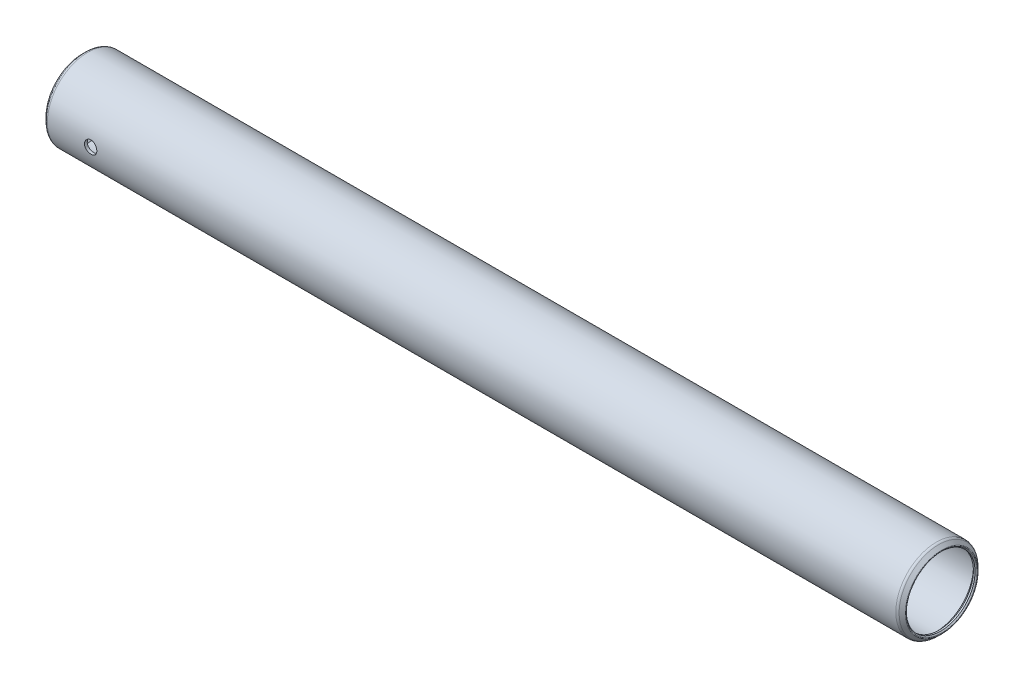
ISO-10303-21;
HEADER;
FILE_DESCRIPTION(('STEP AP214'),'2;1');
FILE_NAME('part.step','',(''),(''),'','','');
FILE_SCHEMA(('AUTOMOTIVE_DESIGN { 1 0 10303 214 1 1 1 1 }'));
ENDSEC;
DATA;
#1=APPLICATION_CONTEXT('core data for automotive mechanical design processes');
#2=APPLICATION_PROTOCOL_DEFINITION('international standard','automotive_design',2000,#1);
#3=PRODUCT_CONTEXT('',#1,'mechanical');
#4=PRODUCT('Part','Part','',(#3));
#5=PRODUCT_RELATED_PRODUCT_CATEGORY('part','',(#4));
#6=PRODUCT_DEFINITION_FORMATION('','',#4);
#7=PRODUCT_DEFINITION_CONTEXT('part definition',#1,'design');
#8=PRODUCT_DEFINITION('design','',#6,#7);
#9=PRODUCT_DEFINITION_SHAPE('','',#8);
#10=(LENGTH_UNIT() NAMED_UNIT(*) SI_UNIT(.MILLI.,.METRE.));
#11=(NAMED_UNIT(*) PLANE_ANGLE_UNIT() SI_UNIT($,.RADIAN.));
#12=(NAMED_UNIT(*) SI_UNIT($,.STERADIAN.) SOLID_ANGLE_UNIT());
#13=UNCERTAINTY_MEASURE_WITH_UNIT(LENGTH_MEASURE(1.E-05),#10,'distance_accuracy_value','');
#14=(GEOMETRIC_REPRESENTATION_CONTEXT(3) GLOBAL_UNCERTAINTY_ASSIGNED_CONTEXT((#13)) GLOBAL_UNIT_ASSIGNED_CONTEXT((#10,
#11,#12)) REPRESENTATION_CONTEXT('',''));
#15=CARTESIAN_POINT('',(0.,0.,0.));
#16=DIRECTION('',(0.,0.,1.));
#17=DIRECTION('',(1.,0.,0.));
#18=AXIS2_PLACEMENT_3D('',#15,#16,#17);
#19=CARTESIAN_POINT('',(164.8714,0.,0.));
#20=DIRECTION('',(-1.,0.,0.));
#21=DIRECTION('',(0.,0.,1.));
#22=AXIS2_PLACEMENT_3D('',#19,#20,#21);
#23=CYLINDRICAL_SURFACE('',#22,7.27075);
#24=CARTESIAN_POINT('',(0.634999999999997,0.,0.));
#25=DIRECTION('',(-1.,0.,0.));
#26=DIRECTION('',(0.,0.,1.));
#27=AXIS2_PLACEMENT_3D('',#24,#25,#26);
#28=CIRCLE('',#27,7.27075);
#29=CARTESIAN_POINT('',(0.634999999999997,0.,7.27075));
#30=VERTEX_POINT('',#29);
#31=EDGE_CURVE('E56',#30,#30,#28,.T.);
#32=ORIENTED_EDGE('',*,*,#31,.T.);
#33=EDGE_LOOP('',(#32));
#34=FACE_BOUND('',#33,.T.);
#35=CARTESIAN_POINT('',(164.2364,0.,0.));
#36=DIRECTION('',(-1.,0.,0.));
#37=DIRECTION('',(0.,0.,1.));
#38=AXIS2_PLACEMENT_3D('',#35,#36,#37);
#39=CIRCLE('',#38,7.27075);
#40=CARTESIAN_POINT('',(164.2364,0.,7.27075));
#41=VERTEX_POINT('',#40);
#42=EDGE_CURVE('E59',#41,#41,#39,.T.);
#43=ORIENTED_EDGE('',*,*,#42,.F.);
#44=EDGE_LOOP('',(#43));
#45=FACE_BOUND('',#44,.T.);
#46=CARTESIAN_POINT('',(10.0838,0.,7.27075));
#47=CARTESIAN_POINT('',(10.0837973180497,-0.066576365622315,7.27074886912623));
#48=CARTESIAN_POINT('',(10.0782118981357,-0.133189422139323,7.26982603229932));
#49=CARTESIAN_POINT('',(10.0560265204291,-0.264548230355834,7.26623351045891));
#50=CARTESIAN_POINT('',(10.0394163416924,-0.329292191059067,7.26356220448896));
#51=CARTESIAN_POINT('',(9.99569566198161,-0.454993226185557,7.25677245539045));
#52=CARTESIAN_POINT('',(9.96859364975716,-0.515953315921061,7.25265518241654));
#53=CARTESIAN_POINT('',(9.90468063110018,-0.632452772924966,7.24342655383445));
#54=CARTESIAN_POINT('',(9.86787077172315,-0.687992779555633,7.23831531568951));
#55=CARTESIAN_POINT('',(9.78522309678459,-0.792599473441388,7.22761255264284));
#56=CARTESIAN_POINT('',(9.73931276800991,-0.841608503171799,7.22201738797767));
#57=CARTESIAN_POINT('',(9.63992345556096,-0.931264098359722,7.21100533744942));
#58=CARTESIAN_POINT('',(9.5864440012438,-0.971910143426821,7.20558846269812));
#59=CARTESIAN_POINT('',(9.47303978470973,-1.04391602816968,7.19551105091629));
#60=CARTESIAN_POINT('',(9.4130784863992,-1.07521904168257,7.19085521714684));
#61=CARTESIAN_POINT('',(9.28865966029078,-1.12728692857892,7.18287741243743));
#62=CARTESIAN_POINT('',(9.22420242734068,-1.14805249228092,7.17955535412351));
#63=CARTESIAN_POINT('',(9.09323189607469,-1.17827475743791,7.17465739869155));
#64=CARTESIAN_POINT('',(9.02674212310514,-1.18783087478537,7.17306616036318));
#65=CARTESIAN_POINT('',(8.89308526182397,-1.19567118363748,7.1717635771999));
#66=CARTESIAN_POINT('',(8.82591822035366,-1.19395614941143,7.17205210323496));
#67=CARTESIAN_POINT('',(8.69352198271034,-1.17938385727069,7.17446243892077));
#68=CARTESIAN_POINT('',(8.62828012811038,-1.16663813068547,7.17656589715222));
#69=CARTESIAN_POINT('',(8.50087366450289,-1.13054122111993,7.18234037327412));
#70=CARTESIAN_POINT('',(8.43870915827104,-1.10718968419689,7.1860114434795));
#71=CARTESIAN_POINT('',(8.31888728068215,-1.05043049008399,7.19452739942117));
#72=CARTESIAN_POINT('',(8.26125231558848,-1.01697637582203,7.19937768730761));
#73=CARTESIAN_POINT('',(8.15237176299115,-0.940994666220349,7.20970179927714));
#74=CARTESIAN_POINT('',(8.10112667680563,-0.898466359673361,7.21517567221921));
#75=CARTESIAN_POINT('',(8.00583482220782,-0.804935108121529,7.22621089146952));
#76=CARTESIAN_POINT('',(7.9618819845089,-0.753836439796722,7.23177249832445));
#77=CARTESIAN_POINT('',(7.88316045636778,-0.644939097733325,7.24229566674746));
#78=CARTESIAN_POINT('',(7.84839182191106,-0.587140383155391,7.24725722465764));
#79=CARTESIAN_POINT('',(7.78901768412653,-0.466396392315688,7.25602800690079));
#80=CARTESIAN_POINT('',(7.76442031582416,-0.403447044565725,7.25983630820479));
#81=CARTESIAN_POINT('',(7.72617325530037,-0.274234269595053,7.26586402905181));
#82=CARTESIAN_POINT('',(7.71252267456644,-0.207971111808631,7.26808357754679));
#83=CARTESIAN_POINT('',(7.69668363687801,-0.0748214486822748,7.27066641036234));
#84=CARTESIAN_POINT('',(7.69436620334303,-0.00795067683835754,7.27105058098478));
#85=CARTESIAN_POINT('',(7.7009156211892,0.125223792320965,7.26997652394854));
#86=CARTESIAN_POINT('',(7.70978205534316,0.191527510698058,7.2685183650201));
#87=CARTESIAN_POINT('',(7.73834025080113,0.321288563764816,7.26393641843455));
#88=CARTESIAN_POINT('',(7.75796831562904,0.384760293010014,7.26082243459669));
#89=CARTESIAN_POINT('',(7.80742481444332,0.507512183164865,7.25327664455669));
#90=CARTESIAN_POINT('',(7.8372538071436,0.566792114271337,7.24884476617403));
#91=CARTESIAN_POINT('',(7.90656193459883,0.680038969103149,7.23910314951883));
#92=CARTESIAN_POINT('',(7.94612182885248,0.73395583434289,7.23378619167638));
#93=CARTESIAN_POINT('',(8.03365749864083,0.834431646594976,7.22288641864574));
#94=CARTESIAN_POINT('',(8.0816338663578,0.880990075429964,7.21730358477068));
#95=CARTESIAN_POINT('',(8.1852184168714,0.965904124062183,7.20643394566787));
#96=CARTESIAN_POINT('',(8.24089837915758,1.00417270523438,7.20115067484654));
#97=CARTESIAN_POINT('',(8.3579721887638,1.07081332476845,7.19154383416012));
#98=CARTESIAN_POINT('',(8.41936585880266,1.09918567005467,7.18722023453304));
#99=CARTESIAN_POINT('',(8.54587847689332,1.14509752192922,7.18004864937368));
#100=CARTESIAN_POINT('',(8.61098121151069,1.16268073492793,7.1771947179269));
#101=CARTESIAN_POINT('',(8.74326673649393,1.18665298984634,7.17327054668051));
#102=CARTESIAN_POINT('',(8.81044935138015,1.19304297353448,7.17220015681885));
#103=CARTESIAN_POINT('',(8.94411868459628,1.19442171212747,7.17197059783136));
#104=CARTESIAN_POINT('',(9.01060399046328,1.18954744526785,7.17278846653603));
#105=CARTESIAN_POINT('',(9.14179495108415,1.16883182625237,7.17619301197557));
#106=CARTESIAN_POINT('',(9.2065006111217,1.1529905066609,7.17877968345834));
#107=CARTESIAN_POINT('',(9.33224486958994,1.11084231835238,7.1854217631554));
#108=CARTESIAN_POINT('',(9.39328739677579,1.08454690132198,7.18947556380448));
#109=CARTESIAN_POINT('',(9.51011662462723,1.02225094487892,7.19859675637365));
#110=CARTESIAN_POINT('',(9.56590307708314,0.986249947445484,7.20366419612596));
#111=CARTESIAN_POINT('',(9.67132924911467,0.905074532377647,7.21431465232543));
#112=CARTESIAN_POINT('',(9.72089077079237,0.859799232508818,7.21990293486049));
#113=CARTESIAN_POINT('',(9.81176008561317,0.761573252640159,7.23092311461084));
#114=CARTESIAN_POINT('',(9.85306596960377,0.708620802139119,7.23635497540492));
#115=CARTESIAN_POINT('',(9.92650298013843,0.596123613416148,7.24649227103988));
#116=CARTESIAN_POINT('',(9.95857094627367,0.536537183511493,7.25119260851974));
#117=CARTESIAN_POINT('',(10.0121932411223,0.412771011536574,7.25928761210429));
#118=CARTESIAN_POINT('',(10.0337581058519,0.348595946921127,7.26268358593417));
#119=CARTESIAN_POINT('',(10.0610484764275,0.23680447760754,7.26704084527022));
#120=CARTESIAN_POINT('',(10.0695667313465,0.189866582690181,7.26842438895746));
#121=CARTESIAN_POINT('',(10.0809434065435,0.0952920506420502,7.27027936357523));
#122=CARTESIAN_POINT('',(10.0838019197425,0.0476554249959265,7.27075080948051));
#123=CARTESIAN_POINT('',(10.0838,0.,7.27075));
#124=B_SPLINE_CURVE_WITH_KNOTS('',3,(#46,#47,#48,#49,#50,#51,#52,#53,#54,#55,#56,#57,#58,#59,
#60,#61,#62,#63,#64,#65,#66,#67,#68,#69,#70,#71,#72,#73,#74,#75,#76,#77,#78,#79,#80,#81,#82,#83,
#84,#85,#86,#87,#88,#89,#90,#91,#92,#93,#94,#95,#96,#97,#98,#99,#100,#101,#102,#103,#104,#105,
#106,#107,#108,#109,#110,#111,#112,#113,#114,#115,#116,#117,#118,#119,#120,#121,#122,#123),
.UNSPECIFIED.,.T.,.F.,(4,2,2,2,2,2,2,2,2,2,2,2,2,2,2,2,2,2,2,2,2,2,2,2,2,2,2,2,2,2,2,2,2,2,2,2,
2,2,4),(0.,0.199554911258923,0.399295086783102,0.598873992821057,0.798429327660286,
0.999643746073527,1.20087068135868,1.40329768224392,1.60571142022758,1.80631605458478,
2.00690690859434,2.20549297418438,2.40408566758091,2.60360587488517,2.80314172571708,
3.00507606903131,3.20701164327729,3.40910841558579,3.61118878274413,3.81096394044209,
4.01073164551581,4.20932952359342,4.40793828079643,4.60825451749828,4.80858485408871,
5.01092627175881,5.2132614134035,5.41477139553096,5.61626442233168,5.81532011940715,
6.0143752254305,6.21321287954722,6.41205991875158,6.61319725023661,6.81438104193141,
7.01690935899602,7.2192340924611,7.36207803044844,7.50491962321452),.UNSPECIFIED.);
#125=CARTESIAN_POINT('',(10.0838,0.,7.27075));
#126=VERTEX_POINT('',#125);
#127=EDGE_CURVE('E89',#126,#126,#124,.T.);
#128=ORIENTED_EDGE('',*,*,#127,.F.);
#129=EDGE_LOOP('',(#128));
#130=FACE_BOUND('',#129,.T.);
#131=ADVANCED_FACE('F32',(#34,#45,#130),#23,.F.);
#132=CARTESIAN_POINT('',(164.8714,0.,0.));
#133=DIRECTION('',(-1.,0.,0.));
#134=DIRECTION('',(0.,0.,1.));
#135=AXIS2_PLACEMENT_3D('',#132,#133,#134);
#136=CYLINDRICAL_SURFACE('',#135,7.8105);
#137=CARTESIAN_POINT('',(0.539750000000006,0.,0.));
#138=DIRECTION('',(-1.,0.,0.));
#139=DIRECTION('',(0.,0.,1.));
#140=AXIS2_PLACEMENT_3D('',#137,#138,#139);
#141=CIRCLE('',#140,7.8105);
#142=CARTESIAN_POINT('',(0.539750000000006,0.,7.8105));
#143=VERTEX_POINT('',#142);
#144=EDGE_CURVE('E80',#143,#143,#141,.T.);
#145=ORIENTED_EDGE('',*,*,#144,.F.);
#146=EDGE_LOOP('',(#145));
#147=FACE_BOUND('',#146,.T.);
#148=CARTESIAN_POINT('',(164.33165,0.,0.));
#149=DIRECTION('',(-1.,0.,0.));
#150=DIRECTION('',(0.,0.,1.));
#151=AXIS2_PLACEMENT_3D('',#148,#149,#150);
#152=CIRCLE('',#151,7.8105);
#153=CARTESIAN_POINT('',(164.33165,0.,7.8105));
#154=VERTEX_POINT('',#153);
#155=EDGE_CURVE('E77',#154,#154,#152,.T.);
#156=ORIENTED_EDGE('',*,*,#155,.T.);
#157=EDGE_LOOP('',(#156));
#158=FACE_BOUND('',#157,.T.);
#159=CARTESIAN_POINT('',(7.6962,0.,7.8105));
#160=CARTESIAN_POINT('',(7.69620273646334,-0.0666398329516414,7.81049891819337));
#161=CARTESIAN_POINT('',(7.70179875326354,-0.133317958673531,7.80963820597065));
#162=CARTESIAN_POINT('',(7.72402870307655,-0.264809416860595,7.80628749873903));
#163=CARTESIAN_POINT('',(7.74067328590999,-0.329620887085572,7.80379593176562));
#164=CARTESIAN_POINT('',(7.78449052451775,-0.45545714903395,7.79746342374147));
#165=CARTESIAN_POINT('',(7.81165511534954,-0.516484800065449,7.79362351657722));
#166=CARTESIAN_POINT('',(7.8757213223107,-0.633106599576794,7.78501829240805));
#167=CARTESIAN_POINT('',(7.91262162540386,-0.688701479379162,7.78025310021736));
#168=CARTESIAN_POINT('',(7.99543012509601,-0.793338917825563,7.77028378661992));
#169=CARTESIAN_POINT('',(8.04140162993454,-0.842331101532475,7.76507673604042));
#170=CARTESIAN_POINT('',(8.14091132939096,-0.931937728182254,7.75483341589372));
#171=CARTESIAN_POINT('',(8.19444996561411,-0.972551681845018,7.74979715631489));
#172=CARTESIAN_POINT('',(8.30791388928797,-1.04444602601217,7.74043722961758));
#173=CARTESIAN_POINT('',(8.36787051185987,-1.07567749895494,7.73611734809356));
#174=CARTESIAN_POINT('',(8.49225550746949,-1.12760768906777,7.7287193916199));
#175=CARTESIAN_POINT('',(8.55668362710899,-1.14830700253877,7.72564124636873));
#176=CARTESIAN_POINT('',(8.68765223456345,-1.17842847148577,7.72110413933663));
#177=CARTESIAN_POINT('',(8.75417242189646,-1.18793699259909,7.71963278351321));
#178=CARTESIAN_POINT('',(8.88787920779012,-1.19567455444233,7.71843824249885));
#179=CARTESIAN_POINT('',(8.95506576640224,-1.19390426729727,7.7187149531374));
#180=CARTESIAN_POINT('',(9.08758697080283,-1.17920500612085,7.72097394960283));
#181=CARTESIAN_POINT('',(9.15293258817671,-1.1663723572181,7.72294151193834));
#182=CARTESIAN_POINT('',(9.2805321334076,-1.13006349376238,7.72833750921248));
#183=CARTESIAN_POINT('',(9.34278597068418,-1.10658696757771,7.73176598692365));
#184=CARTESIAN_POINT('',(9.46272710129188,-1.04955699193537,7.73971371623396));
#185=CARTESIAN_POINT('',(9.52039475442107,-1.01596287319965,7.74423735533787));
#186=CARTESIAN_POINT('',(9.62931092071928,-0.939680275121305,7.75386255655101));
#187=CARTESIAN_POINT('',(9.68055899632882,-0.896991176398325,7.75896415800917));
#188=CARTESIAN_POINT('',(9.77573941516313,-0.803202302304859,7.76923545638721));
#189=CARTESIAN_POINT('',(9.81959020348762,-0.752019737516411,7.77440531003558));
#190=CARTESIAN_POINT('',(9.89809225721203,-0.642978628610851,7.78418140470635));
#191=CARTESIAN_POINT('',(9.93274347948591,-0.58512005319953,7.78878764308655));
#192=CARTESIAN_POINT('',(9.99186750062159,-0.464297644984686,7.79692259066929));
#193=CARTESIAN_POINT('',(10.0163338579518,-0.401330611265675,7.80045061757113));
#194=CARTESIAN_POINT('',(10.0543219566975,-0.272115525346046,7.80602596435751));
#195=CARTESIAN_POINT('',(10.0678444666427,-0.205867703884927,7.80807338821605));
#196=CARTESIAN_POINT('',(10.083452224923,-0.0726752961455404,7.81044303454276));
#197=CARTESIAN_POINT('',(10.0856495678188,-0.00574413515528593,7.81078216464642));
#198=CARTESIAN_POINT('',(10.0788423665272,0.127530731520344,7.8097430834034));
#199=CARTESIAN_POINT('',(10.0698381828088,0.193874456040439,7.80836492731958));
#200=CARTESIAN_POINT('',(10.0409767408112,0.323750561669986,7.80405658307113));
#201=CARTESIAN_POINT('',(10.021174239059,0.387295393083128,7.801134227589));
#202=CARTESIAN_POINT('',(9.97133612750317,0.510163039330169,7.79406405147403));
#203=CARTESIAN_POINT('',(9.94130002129567,0.569485649186971,7.78991617139567));
#204=CARTESIAN_POINT('',(9.87158535899785,0.682716826559532,7.78081374744967));
#205=CARTESIAN_POINT('',(9.8318358743346,0.736581246218948,7.7758533626488));
#206=CARTESIAN_POINT('',(9.74392135369307,0.836914777941201,7.76569582861299));
#207=CARTESIAN_POINT('',(9.69575580884511,0.883383442501374,7.76049866507547));
#208=CARTESIAN_POINT('',(9.59187676543193,0.968015516456356,7.75039953957522));
#209=CARTESIAN_POINT('',(9.53610163726457,1.00610368490327,7.74550051674064));
#210=CARTESIAN_POINT('',(9.41887926951428,1.0723701852063,7.73660487547725));
#211=CARTESIAN_POINT('',(9.35743218781286,1.10054879279477,7.73260823194096));
#212=CARTESIAN_POINT('',(9.23083223960826,1.14608033509009,7.72599126936372));
#213=CARTESIAN_POINT('',(9.16569375894266,1.16347251312677,7.72336596666016));
#214=CARTESIAN_POINT('',(9.03337714917995,1.18706217797389,7.7197758016584));
#215=CARTESIAN_POINT('',(8.96619916717398,1.19326047015901,7.7188108199041));
#216=CARTESIAN_POINT('',(8.83246065644958,1.19426671409332,7.71865513002324));
#217=CARTESIAN_POINT('',(8.7659010093451,1.1891929893523,7.71944599058299));
#218=CARTESIAN_POINT('',(8.63459358788535,1.16805316013447,7.7226727629834));
#219=CARTESIAN_POINT('',(8.56984581017547,1.15198707601091,7.72510867177811));
#220=CARTESIAN_POINT('',(8.44403499975099,1.10936100617533,7.7313445390143));
#221=CARTESIAN_POINT('',(8.3829689992873,1.08280960626525,7.73514338119836));
#222=CARTESIAN_POINT('',(8.2661392148611,1.01997843077836,7.74367839169512));
#223=CARTESIAN_POINT('',(8.21037562436221,0.983698300423657,7.74841459418893));
#224=CARTESIAN_POINT('',(8.1051329581918,0.902010873076255,7.75834980029298));
#225=CARTESIAN_POINT('',(8.05572221542002,0.85651603304771,7.76355295388559));
#226=CARTESIAN_POINT('',(7.96519469079388,0.757875626120004,7.77380140805301));
#227=CARTESIAN_POINT('',(7.92407983676741,0.704728285811561,7.77884667170718));
#228=CARTESIAN_POINT('',(7.85109994244319,0.591932735192255,7.78824397715299));
#229=CARTESIAN_POINT('',(7.81928922643542,0.532249036280569,7.79259188322355));
#230=CARTESIAN_POINT('',(7.7661918482117,0.408346764692882,7.80006409876217));
#231=CARTESIAN_POINT('',(7.74489435433406,0.344132937672259,7.80318966689916));
#232=CARTESIAN_POINT('',(7.71822554780552,0.233031005484256,7.80715669112726));
#233=CARTESIAN_POINT('',(7.70997868826911,0.18682655953323,7.80840395032583));
#234=CARTESIAN_POINT('',(7.69896498773605,0.0937543885835004,7.81007597992434));
#235=CARTESIAN_POINT('',(7.69619807467015,0.0468866723159289,7.81050076114106));
#236=CARTESIAN_POINT('',(7.6962,0.,7.8105));
#237=B_SPLINE_CURVE_WITH_KNOTS('',3,(#159,#160,#161,#162,#163,#164,#165,#166,#167,#168,#169,
#170,#171,#172,#173,#174,#175,#176,#177,#178,#179,#180,#181,#182,#183,#184,#185,#186,#187,#188,
#189,#190,#191,#192,#193,#194,#195,#196,#197,#198,#199,#200,#201,#202,#203,#204,#205,#206,#207,
#208,#209,#210,#211,#212,#213,#214,#215,#216,#217,#218,#219,#220,#221,#222,#223,#224,#225,#226,
#227,#228,#229,#230,#231,#232,#233,#234,#235,#236),.UNSPECIFIED.,.T.,.F.,(4,2,2,2,2,2,2,2,2,2,2,
2,2,2,2,2,2,2,2,2,2,2,2,2,2,2,2,2,2,2,2,2,2,2,2,2,2,2,4),(0.,0.19974816092799,0.39968914119229,
0.59947714338181,0.799238214321461,1.00044615223429,1.20166583716145,1.40391710936528,
1.60615692940231,1.80682549746078,2.00748210742069,2.20640895504944,2.40534162723934,
2.60508486269441,2.80484170528285,3.00667430995353,3.20850786076535,3.41046887022643,
3.6124156957815,3.81235979416098,4.01229745843626,4.21123057359261,4.41017333981954,
4.61061466461079,4.81106811310709,5.01325380238516,5.21543386542509,5.41687397158723,
5.61829958401355,5.81762081177558,6.01694167047901,6.21609965447677,6.41526490216263,
6.61641941723699,6.81762062360688,7.01997415275214,7.22211876178159,7.36266007656324,
7.50319954301023),.UNSPECIFIED.);
#238=CARTESIAN_POINT('',(7.6962,0.,7.8105));
#239=VERTEX_POINT('',#238);
#240=EDGE_CURVE('E10',#239,#239,#237,.T.);
#241=ORIENTED_EDGE('',*,*,#240,.F.);
#242=EDGE_LOOP('',(#241));
#243=FACE_BOUND('',#242,.T.);
#244=ADVANCED_FACE('F110',(#147,#158,#243),#136,.T.);
#245=CARTESIAN_POINT('',(-0.428157683632184,0.,0.));
#246=DIRECTION('',(-1.,0.,0.));
#247=DIRECTION('',(0.,0.,1.));
#248=AXIS2_PLACEMENT_3D('',#245,#246,#247);
#249=TOROIDAL_SURFACE('',#248,6.92601280605345,0.126999999999896);
#250=CARTESIAN_POINT('',(-0.517960244842769,0.,0.));
#251=DIRECTION('',(-1.,0.,0.));
#252=DIRECTION('',(0.,0.,1.));
#253=AXIS2_PLACEMENT_3D('',#250,#251,#252);
#254=CIRCLE('',#253,6.8362102448428);
#255=CARTESIAN_POINT('',(-0.517960244842769,0.,6.8362102448428));
#256=VERTEX_POINT('',#255);
#257=EDGE_CURVE('E43',#256,#256,#254,.T.);
#258=ORIENTED_EDGE('',*,*,#257,.F.);
#259=EDGE_LOOP('',(#258));
#260=FACE_BOUND('',#259,.T.);
#261=CARTESIAN_POINT('',(-0.517960244842769,0.,0.));
#262=DIRECTION('',(-1.,0.,0.));
#263=DIRECTION('',(0.,0.,1.));
#264=AXIS2_PLACEMENT_3D('',#261,#262,#263);
#265=CIRCLE('',#264,7.0158153672641);
#266=CARTESIAN_POINT('',(-0.517960244842769,0.,7.0158153672641));
#267=VERTEX_POINT('',#266);
#268=EDGE_CURVE('E86',#267,#267,#265,.T.);
#269=ORIENTED_EDGE('',*,*,#268,.T.);
#270=EDGE_LOOP('',(#269));
#271=FACE_BOUND('',#270,.T.);
#272=ADVANCED_FACE('F34',(#260,#271),#249,.T.);
#273=CARTESIAN_POINT('',(-0.517960244842769,0.,0.));
#274=DIRECTION('',(-1.,0.,0.));
#275=DIRECTION('',(0.,0.,1.));
#276=AXIS2_PLACEMENT_3D('',#273,#274,#275);
#277=CONICAL_SURFACE('',#276,6.8362102448428,0.785398163397522);
#278=CARTESIAN_POINT('',(-0.317499999999998,0.,0.));
#279=DIRECTION('',(-1.,0.,0.));
#280=DIRECTION('',(0.,0.,1.));
#281=AXIS2_PLACEMENT_3D('',#278,#279,#280);
#282=CIRCLE('',#281,6.63575);
#283=CARTESIAN_POINT('',(-0.317499999999998,0.,6.63575));
#284=VERTEX_POINT('',#283);
#285=EDGE_CURVE('E47',#284,#284,#282,.T.);
#286=ORIENTED_EDGE('',*,*,#285,.F.);
#287=EDGE_LOOP('',(#286));
#288=FACE_BOUND('',#287,.T.);
#289=ORIENTED_EDGE('',*,*,#257,.T.);
#290=EDGE_LOOP('',(#289));
#291=FACE_BOUND('',#290,.T.);
#292=ADVANCED_FACE('F159',(#288,#291),#277,.F.);
#293=CARTESIAN_POINT('',(164.8714,0.,0.));
#294=DIRECTION('',(-1.,0.,0.));
#295=DIRECTION('',(0.,0.,1.));
#296=AXIS2_PLACEMENT_3D('',#293,#294,#295);
#297=CYLINDRICAL_SURFACE('',#296,6.63575);
#298=CARTESIAN_POINT('',(0.,0.,0.));
#299=DIRECTION('',(-1.,0.,0.));
#300=DIRECTION('',(0.,0.,1.));
#301=AXIS2_PLACEMENT_3D('',#298,#299,#300);
#302=CIRCLE('',#301,6.63575);
#303=CARTESIAN_POINT('',(0.,0.,6.63575));
#304=VERTEX_POINT('',#303);
#305=EDGE_CURVE('E51',#304,#304,#302,.T.);
#306=ORIENTED_EDGE('',*,*,#305,.F.);
#307=EDGE_LOOP('',(#306));
#308=FACE_BOUND('',#307,.T.);
#309=ORIENTED_EDGE('',*,*,#285,.T.);
#310=EDGE_LOOP('',(#309));
#311=FACE_BOUND('',#310,.T.);
#312=ADVANCED_FACE('F140',(#308,#311),#297,.F.);
#313=CARTESIAN_POINT('',(0.,0.,0.));
#314=DIRECTION('',(1.,0.,0.));
#315=DIRECTION('',(0.,0.,-1.));
#316=AXIS2_PLACEMENT_3D('',#313,#314,#315);
#317=CONICAL_SURFACE('',#316,6.63575,0.78539816339745);
#318=ORIENTED_EDGE('',*,*,#31,.F.);
#319=EDGE_LOOP('',(#318));
#320=FACE_BOUND('',#319,.T.);
#321=ORIENTED_EDGE('',*,*,#305,.T.);
#322=EDGE_LOOP('',(#321));
#323=FACE_BOUND('',#322,.T.);
#324=ADVANCED_FACE('F135',(#320,#323),#317,.F.);
#325=CARTESIAN_POINT('',(164.2364,0.,0.));
#326=DIRECTION('',(-1.,0.,0.));
#327=DIRECTION('',(0.,0.,1.));
#328=AXIS2_PLACEMENT_3D('',#325,#326,#327);
#329=CONICAL_SURFACE('',#328,7.27075,0.78539816339745);
#330=CARTESIAN_POINT('',(164.8714,0.,0.));
#331=DIRECTION('',(-1.,0.,0.));
#332=DIRECTION('',(0.,0.,1.));
#333=AXIS2_PLACEMENT_3D('',#330,#331,#332);
#334=CIRCLE('',#333,6.63575);
#335=CARTESIAN_POINT('',(164.8714,0.,6.63575));
#336=VERTEX_POINT('',#335);
#337=EDGE_CURVE('E62',#336,#336,#334,.T.);
#338=ORIENTED_EDGE('',*,*,#337,.F.);
#339=EDGE_LOOP('',(#338));
#340=FACE_BOUND('',#339,.T.);
#341=ORIENTED_EDGE('',*,*,#42,.T.);
#342=EDGE_LOOP('',(#341));
#343=FACE_BOUND('',#342,.T.);
#344=ADVANCED_FACE('F132',(#340,#343),#329,.F.);
#345=CARTESIAN_POINT('',(164.8714,0.,0.));
#346=DIRECTION('',(-1.,0.,0.));
#347=DIRECTION('',(0.,0.,1.));
#348=AXIS2_PLACEMENT_3D('',#345,#346,#347);
#349=CYLINDRICAL_SURFACE('',#348,6.63575);
#350=CARTESIAN_POINT('',(165.1889,0.,0.));
#351=DIRECTION('',(-1.,0.,0.));
#352=DIRECTION('',(0.,0.,1.));
#353=AXIS2_PLACEMENT_3D('',#350,#351,#352);
#354=CIRCLE('',#353,6.63575);
#355=CARTESIAN_POINT('',(165.1889,0.,6.63575));
#356=VERTEX_POINT('',#355);
#357=EDGE_CURVE('E65',#356,#356,#354,.T.);
#358=ORIENTED_EDGE('',*,*,#357,.F.);
#359=EDGE_LOOP('',(#358));
#360=FACE_BOUND('',#359,.T.);
#361=ORIENTED_EDGE('',*,*,#337,.T.);
#362=EDGE_LOOP('',(#361));
#363=FACE_BOUND('',#362,.T.);
#364=ADVANCED_FACE('F129',(#360,#363),#349,.F.);
#365=CARTESIAN_POINT('',(165.1889,0.,0.));
#366=DIRECTION('',(1.,0.,0.));
#367=DIRECTION('',(0.,0.,-1.));
#368=AXIS2_PLACEMENT_3D('',#365,#366,#367);
#369=CONICAL_SURFACE('',#368,6.63575,0.785398163397448);
#370=CARTESIAN_POINT('',(165.389360244841,0.,0.));
#371=DIRECTION('',(-1.,0.,0.));
#372=DIRECTION('',(0.,0.,1.));
#373=AXIS2_PLACEMENT_3D('',#370,#371,#372);
#374=CIRCLE('',#373,6.83621024484141);
#375=CARTESIAN_POINT('',(165.389360244841,0.,6.83621024484141));
#376=VERTEX_POINT('',#375);
#377=EDGE_CURVE('E68',#376,#376,#374,.T.);
#378=ORIENTED_EDGE('',*,*,#377,.F.);
#379=EDGE_LOOP('',(#378));
#380=FACE_BOUND('',#379,.T.);
#381=ORIENTED_EDGE('',*,*,#357,.T.);
#382=EDGE_LOOP('',(#381));
#383=FACE_BOUND('',#382,.T.);
#384=ADVANCED_FACE('F125',(#380,#383),#369,.F.);
#385=CARTESIAN_POINT('',(165.299557683633,0.,0.));
#386=DIRECTION('',(-1.,0.,0.));
#387=DIRECTION('',(0.,0.,1.));
#388=AXIS2_PLACEMENT_3D('',#385,#386,#387);
#389=TOROIDAL_SURFACE('',#388,6.92601280605173,0.126999999998357);
#390=CARTESIAN_POINT('',(165.389360244842,0.,0.));
#391=DIRECTION('',(-1.,0.,0.));
#392=DIRECTION('',(0.,0.,1.));
#393=AXIS2_PLACEMENT_3D('',#390,#391,#392);
#394=CIRCLE('',#393,7.01581536726144);
#395=CARTESIAN_POINT('',(165.389360244842,0.,7.01581536726144));
#396=VERTEX_POINT('',#395);
#397=EDGE_CURVE('E71',#396,#396,#394,.T.);
#398=ORIENTED_EDGE('',*,*,#397,.F.);
#399=EDGE_LOOP('',(#398));
#400=FACE_BOUND('',#399,.T.);
#401=ORIENTED_EDGE('',*,*,#377,.T.);
#402=EDGE_LOOP('',(#401));
#403=FACE_BOUND('',#402,.T.);
#404=ADVANCED_FACE('F121',(#400,#403),#389,.T.);
#405=CARTESIAN_POINT('',(165.389360244842,0.,0.));
#406=DIRECTION('',(-1.,0.,0.));
#407=DIRECTION('',(0.,0.,1.));
#408=AXIS2_PLACEMENT_3D('',#405,#406,#407);
#409=CONICAL_SURFACE('',#408,7.01581536726144,0.785398163397488);
#410=CARTESIAN_POINT('',(164.780662806048,0.,0.));
#411=DIRECTION('',(-1.,0.,0.));
#412=DIRECTION('',(0.,0.,1.));
#413=AXIS2_PLACEMENT_3D('',#410,#411,#412);
#414=CIRCLE('',#413,7.62451280605568);
#415=CARTESIAN_POINT('',(164.780662806048,0.,7.62451280605568));
#416=VERTEX_POINT('',#415);
#417=EDGE_CURVE('E74',#416,#416,#414,.T.);
#418=ORIENTED_EDGE('',*,*,#417,.F.);
#419=EDGE_LOOP('',(#418));
#420=FACE_BOUND('',#419,.T.);
#421=ORIENTED_EDGE('',*,*,#397,.T.);
#422=EDGE_LOOP('',(#421));
#423=FACE_BOUND('',#422,.T.);
#424=ADVANCED_FACE('F117',(#420,#423),#409,.T.);
#425=CARTESIAN_POINT('',(164.33165,0.,0.));
#426=DIRECTION('',(-1.,0.,0.));
#427=DIRECTION('',(0.,0.,1.));
#428=AXIS2_PLACEMENT_3D('',#425,#426,#427);
#429=TOROIDAL_SURFACE('',#428,7.17550000000768,0.634999999992296);
#430=ORIENTED_EDGE('',*,*,#155,.F.);
#431=EDGE_LOOP('',(#430));
#432=FACE_BOUND('',#431,.T.);
#433=ORIENTED_EDGE('',*,*,#417,.T.);
#434=EDGE_LOOP('',(#433));
#435=FACE_BOUND('',#434,.T.);
#436=ADVANCED_FACE('F108',(#432,#435),#429,.T.);
#437=CARTESIAN_POINT('',(0.539749999999892,0.,0.));
#438=DIRECTION('',(-1.,0.,0.));
#439=DIRECTION('',(0.,0.,1.));
#440=AXIS2_PLACEMENT_3D('',#437,#438,#439);
#441=TOROIDAL_SURFACE('',#440,7.17550000000016,0.634999999999845);
#442=CARTESIAN_POINT('',(0.0907371939465329,0.,0.));
#443=DIRECTION('',(-1.,0.,0.));
#444=DIRECTION('',(0.,0.,1.));
#445=AXIS2_PLACEMENT_3D('',#442,#443,#444);
#446=CIRCLE('',#445,7.6245128060535);
#447=CARTESIAN_POINT('',(0.0907371939465329,0.,7.6245128060535));
#448=VERTEX_POINT('',#447);
#449=EDGE_CURVE('E83',#448,#448,#446,.T.);
#450=ORIENTED_EDGE('',*,*,#449,.F.);
#451=EDGE_LOOP('',(#450));
#452=FACE_BOUND('',#451,.T.);
#453=ORIENTED_EDGE('',*,*,#144,.T.);
#454=EDGE_LOOP('',(#453));
#455=FACE_BOUND('',#454,.T.);
#456=ADVANCED_FACE('F105',(#452,#455),#441,.T.);
#457=CARTESIAN_POINT('',(0.0907371939465329,0.,0.));
#458=DIRECTION('',(1.,0.,0.));
#459=DIRECTION('',(0.,0.,-1.));
#460=AXIS2_PLACEMENT_3D('',#457,#458,#459);
#461=CONICAL_SURFACE('',#460,7.6245128060535,0.785398163397529);
#462=ORIENTED_EDGE('',*,*,#268,.F.);
#463=EDGE_LOOP('',(#462));
#464=FACE_BOUND('',#463,.T.);
#465=ORIENTED_EDGE('',*,*,#449,.T.);
#466=EDGE_LOOP('',(#465));
#467=FACE_BOUND('',#466,.T.);
#468=ADVANCED_FACE('F101',(#464,#467),#461,.T.);
#469=CARTESIAN_POINT('',(8.89,0.,7.8105));
#470=DIRECTION('',(0.,0.,-1.));
#471=DIRECTION('',(-1.,0.,0.));
#472=AXIS2_PLACEMENT_3D('',#469,#470,#471);
#473=CYLINDRICAL_SURFACE('',#472,1.1938);
#474=ORIENTED_EDGE('',*,*,#240,.T.);
#475=EDGE_LOOP('',(#474));
#476=FACE_BOUND('',#475,.T.);
#477=ORIENTED_EDGE('',*,*,#127,.T.);
#478=EDGE_LOOP('',(#477));
#479=FACE_BOUND('',#478,.T.);
#480=ADVANCED_FACE('F97',(#476,#479),#473,.F.);
#481=CLOSED_SHELL('',(#131,#244,#272,#292,#312,#324,#344,#364,#384,#404,#424,#436,#456,#468,#480));
#482=MANIFOLD_SOLID_BREP('B2',#481);
#483=ADVANCED_BREP_SHAPE_REPRESENTATION('',(#18,#482),#14);
#484=SHAPE_DEFINITION_REPRESENTATION(#9,#483);
ENDSEC;
END-ISO-10303-21;
